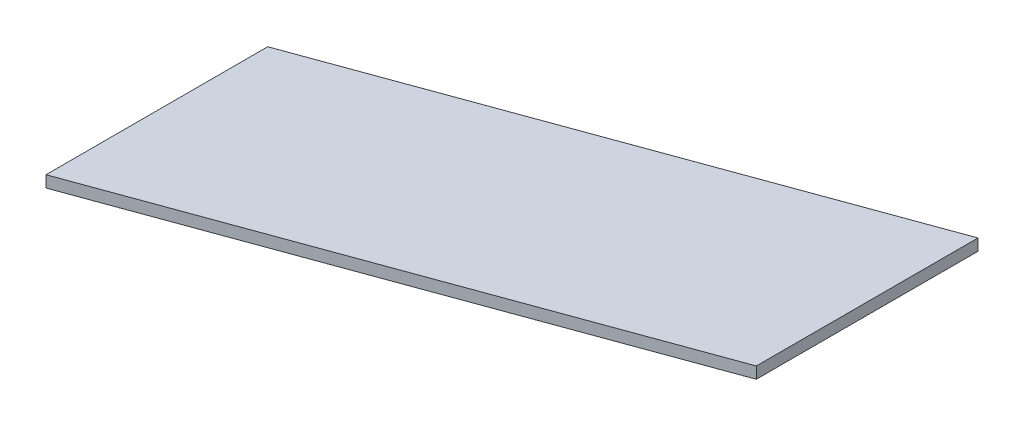
ISO-10303-21;
HEADER;
FILE_DESCRIPTION(('STEP AP214'),'2;1');
FILE_NAME('part.step','',(''),(''),'','','');
FILE_SCHEMA(('AUTOMOTIVE_DESIGN { 1 0 10303 214 1 1 1 1 }'));
ENDSEC;
DATA;
#1=APPLICATION_CONTEXT('core data for automotive mechanical design processes');
#2=APPLICATION_PROTOCOL_DEFINITION('international standard','automotive_design',2000,#1);
#3=PRODUCT_CONTEXT('',#1,'mechanical');
#4=PRODUCT('Part','Part','',(#3));
#5=PRODUCT_RELATED_PRODUCT_CATEGORY('part','',(#4));
#6=PRODUCT_DEFINITION_FORMATION('','',#4);
#7=PRODUCT_DEFINITION_CONTEXT('part definition',#1,'design');
#8=PRODUCT_DEFINITION('design','',#6,#7);
#9=PRODUCT_DEFINITION_SHAPE('','',#8);
#10=(LENGTH_UNIT() NAMED_UNIT(*) SI_UNIT(.MILLI.,.METRE.));
#11=(NAMED_UNIT(*) PLANE_ANGLE_UNIT() SI_UNIT($,.RADIAN.));
#12=(NAMED_UNIT(*) SI_UNIT($,.STERADIAN.) SOLID_ANGLE_UNIT());
#13=UNCERTAINTY_MEASURE_WITH_UNIT(LENGTH_MEASURE(1.E-05),#10,'distance_accuracy_value','');
#14=(GEOMETRIC_REPRESENTATION_CONTEXT(3) GLOBAL_UNCERTAINTY_ASSIGNED_CONTEXT((#13)) GLOBAL_UNIT_ASSIGNED_CONTEXT((#10,
#11,#12)) REPRESENTATION_CONTEXT('',''));
#15=CARTESIAN_POINT('',(0.,0.,0.));
#16=DIRECTION('',(0.,0.,1.));
#17=DIRECTION('',(1.,0.,0.));
#18=AXIS2_PLACEMENT_3D('',#15,#16,#17);
#19=CARTESIAN_POINT('',(143.209155407773,3.175,8.83613015716842));
#20=DIRECTION('',(-0.342020143325666,0.,-0.939692620785909));
#21=DIRECTION('',(-0.939692620785909,0.,0.342020143325666));
#22=AXIS2_PLACEMENT_3D('',#19,#20,#21);
#23=PLANE('',#22);
#24=DIRECTION('',(0.939692620785909,0.,-0.342020143325666));
#25=VECTOR('',#24,1.);
#26=CARTESIAN_POINT('',(143.209155407773,0.,8.83613015716842));
#27=LINE('',#26,#25);
#28=CARTESIAN_POINT('',(0.,0.,60.96));
#29=VERTEX_POINT('',#28);
#30=CARTESIAN_POINT('',(143.209155407773,0.,8.83613015716842));
#31=VERTEX_POINT('',#30);
#32=EDGE_CURVE('E103',#29,#31,#27,.T.);
#33=ORIENTED_EDGE('',*,*,#32,.T.);
#34=DIRECTION('',(0.,-1.,0.));
#35=VECTOR('',#34,1.);
#36=CARTESIAN_POINT('',(143.209155407773,3.175,8.83613015716842));
#37=LINE('',#36,#35);
#38=CARTESIAN_POINT('',(143.209155407773,3.175,8.83613015716842));
#39=VERTEX_POINT('',#38);
#40=EDGE_CURVE('E11',#39,#31,#37,.T.);
#41=ORIENTED_EDGE('',*,*,#40,.F.);
#42=DIRECTION('',(0.939692620785909,0.,-0.342020143325666));
#43=VECTOR('',#42,1.);
#44=CARTESIAN_POINT('',(143.209155407773,3.175,8.83613015716842));
#45=LINE('',#44,#43);
#46=CARTESIAN_POINT('',(0.,3.175,60.96));
#47=VERTEX_POINT('',#46);
#48=EDGE_CURVE('E91',#47,#39,#45,.T.);
#49=ORIENTED_EDGE('',*,*,#48,.F.);
#50=DIRECTION('',(0.,-1.,0.));
#51=VECTOR('',#50,1.);
#52=CARTESIAN_POINT('',(0.,3.175,60.96));
#53=LINE('',#52,#51);
#54=EDGE_CURVE('E99',#47,#29,#53,.T.);
#55=ORIENTED_EDGE('',*,*,#54,.T.);
#56=EDGE_LOOP('',(#33,#41,#49,#55));
#57=FACE_BOUND('',#56,.T.);
#58=ADVANCED_FACE('F40',(#57),#23,.F.);
#59=CARTESIAN_POINT('',(143.209155407773,3.175,-52.1238698428316));
#60=DIRECTION('',(-1.,0.,0.));
#61=DIRECTION('',(0.,0.,1.));
#62=AXIS2_PLACEMENT_3D('',#59,#60,#61);
#63=PLANE('',#62);
#64=DIRECTION('',(0.,0.,-1.));
#65=VECTOR('',#64,1.);
#66=CARTESIAN_POINT('',(143.209155407773,0.,-52.1238698428316));
#67=LINE('',#66,#65);
#68=CARTESIAN_POINT('',(143.209155407773,0.,-52.1238698428316));
#69=VERTEX_POINT('',#68);
#70=EDGE_CURVE('E95',#31,#69,#67,.T.);
#71=ORIENTED_EDGE('',*,*,#70,.T.);
#72=DIRECTION('',(0.,-1.,0.));
#73=VECTOR('',#72,1.);
#74=CARTESIAN_POINT('',(143.209155407773,3.175,-52.1238698428316));
#75=LINE('',#74,#73);
#76=CARTESIAN_POINT('',(143.209155407773,3.175,-52.1238698428316));
#77=VERTEX_POINT('',#76);
#78=EDGE_CURVE('E48',#77,#69,#75,.T.);
#79=ORIENTED_EDGE('',*,*,#78,.F.);
#80=DIRECTION('',(0.,0.,-1.));
#81=VECTOR('',#80,1.);
#82=CARTESIAN_POINT('',(143.209155407773,3.175,-52.1238698428316));
#83=LINE('',#82,#81);
#84=EDGE_CURVE('E86',#39,#77,#83,.T.);
#85=ORIENTED_EDGE('',*,*,#84,.F.);
#86=ORIENTED_EDGE('',*,*,#40,.T.);
#87=EDGE_LOOP('',(#71,#79,#85,#86));
#88=FACE_BOUND('',#87,.T.);
#89=ADVANCED_FACE('F94',(#88),#63,.F.);
#90=CARTESIAN_POINT('',(0.,3.175,0.));
#91=DIRECTION('',(0.342020143325666,0.,0.939692620785909));
#92=DIRECTION('',(0.939692620785909,0.,-0.342020143325666));
#93=AXIS2_PLACEMENT_3D('',#90,#91,#92);
#94=PLANE('',#93);
#95=DIRECTION('',(-0.939692620785909,0.,0.342020143325666));
#96=VECTOR('',#95,1.);
#97=CARTESIAN_POINT('',(0.,0.,0.));
#98=LINE('',#97,#96);
#99=CARTESIAN_POINT('',(0.,0.,0.));
#100=VERTEX_POINT('',#99);
#101=EDGE_CURVE('E73',#69,#100,#98,.T.);
#102=ORIENTED_EDGE('',*,*,#101,.T.);
#103=DIRECTION('',(0.,-1.,0.));
#104=VECTOR('',#103,1.);
#105=CARTESIAN_POINT('',(0.,3.175,0.));
#106=LINE('',#105,#104);
#107=CARTESIAN_POINT('',(0.,3.175,0.));
#108=VERTEX_POINT('',#107);
#109=EDGE_CURVE('E96',#108,#100,#106,.T.);
#110=ORIENTED_EDGE('',*,*,#109,.F.);
#111=DIRECTION('',(-0.939692620785909,0.,0.342020143325666));
#112=VECTOR('',#111,1.);
#113=CARTESIAN_POINT('',(0.,3.175,0.));
#114=LINE('',#113,#112);
#115=EDGE_CURVE('E89',#77,#108,#114,.T.);
#116=ORIENTED_EDGE('',*,*,#115,.F.);
#117=ORIENTED_EDGE('',*,*,#78,.T.);
#118=EDGE_LOOP('',(#102,#110,#116,#117));
#119=FACE_BOUND('',#118,.T.);
#120=ADVANCED_FACE('F97',(#119),#94,.F.);
#121=CARTESIAN_POINT('',(0.,3.175,60.96));
#122=DIRECTION('',(1.,0.,0.));
#123=DIRECTION('',(0.,0.,-1.));
#124=AXIS2_PLACEMENT_3D('',#121,#122,#123);
#125=PLANE('',#124);
#126=DIRECTION('',(0.,0.,1.));
#127=VECTOR('',#126,1.);
#128=CARTESIAN_POINT('',(0.,0.,60.96));
#129=LINE('',#128,#127);
#130=EDGE_CURVE('E79',#100,#29,#129,.T.);
#131=ORIENTED_EDGE('',*,*,#130,.T.);
#132=ORIENTED_EDGE('',*,*,#54,.F.);
#133=DIRECTION('',(0.,0.,1.));
#134=VECTOR('',#133,1.);
#135=CARTESIAN_POINT('',(0.,3.175,60.96));
#136=LINE('',#135,#134);
#137=EDGE_CURVE('E56',#108,#47,#136,.T.);
#138=ORIENTED_EDGE('',*,*,#137,.F.);
#139=ORIENTED_EDGE('',*,*,#109,.T.);
#140=EDGE_LOOP('',(#131,#132,#138,#139));
#141=FACE_BOUND('',#140,.T.);
#142=ADVANCED_FACE('F110',(#141),#125,.F.);
#143=CARTESIAN_POINT('',(0.,3.175,0.));
#144=DIRECTION('',(0.,-1.,0.));
#145=DIRECTION('',(0.,0.,-1.));
#146=AXIS2_PLACEMENT_3D('',#143,#144,#145);
#147=PLANE('',#146);
#148=ORIENTED_EDGE('',*,*,#48,.T.);
#149=ORIENTED_EDGE('',*,*,#84,.T.);
#150=ORIENTED_EDGE('',*,*,#115,.T.);
#151=ORIENTED_EDGE('',*,*,#137,.T.);
#152=EDGE_LOOP('',(#148,#149,#150,#151));
#153=FACE_BOUND('',#152,.T.);
#154=ADVANCED_FACE('F87',(#153),#147,.F.);
#155=CARTESIAN_POINT('',(0.,0.,0.));
#156=DIRECTION('',(0.,-1.,0.));
#157=DIRECTION('',(0.,0.,-1.));
#158=AXIS2_PLACEMENT_3D('',#155,#156,#157);
#159=PLANE('',#158);
#160=ORIENTED_EDGE('',*,*,#32,.F.);
#161=ORIENTED_EDGE('',*,*,#130,.F.);
#162=ORIENTED_EDGE('',*,*,#101,.F.);
#163=ORIENTED_EDGE('',*,*,#70,.F.);
#164=EDGE_LOOP('',(#160,#161,#162,#163));
#165=FACE_BOUND('',#164,.T.);
#166=ADVANCED_FACE('F113',(#165),#159,.T.);
#167=CLOSED_SHELL('',(#58,#89,#120,#142,#154,#166));
#168=MANIFOLD_SOLID_BREP('B2',#167);
#169=ADVANCED_BREP_SHAPE_REPRESENTATION('',(#18,#168),#14);
#170=SHAPE_DEFINITION_REPRESENTATION(#9,#169);
ENDSEC;
END-ISO-10303-21;
